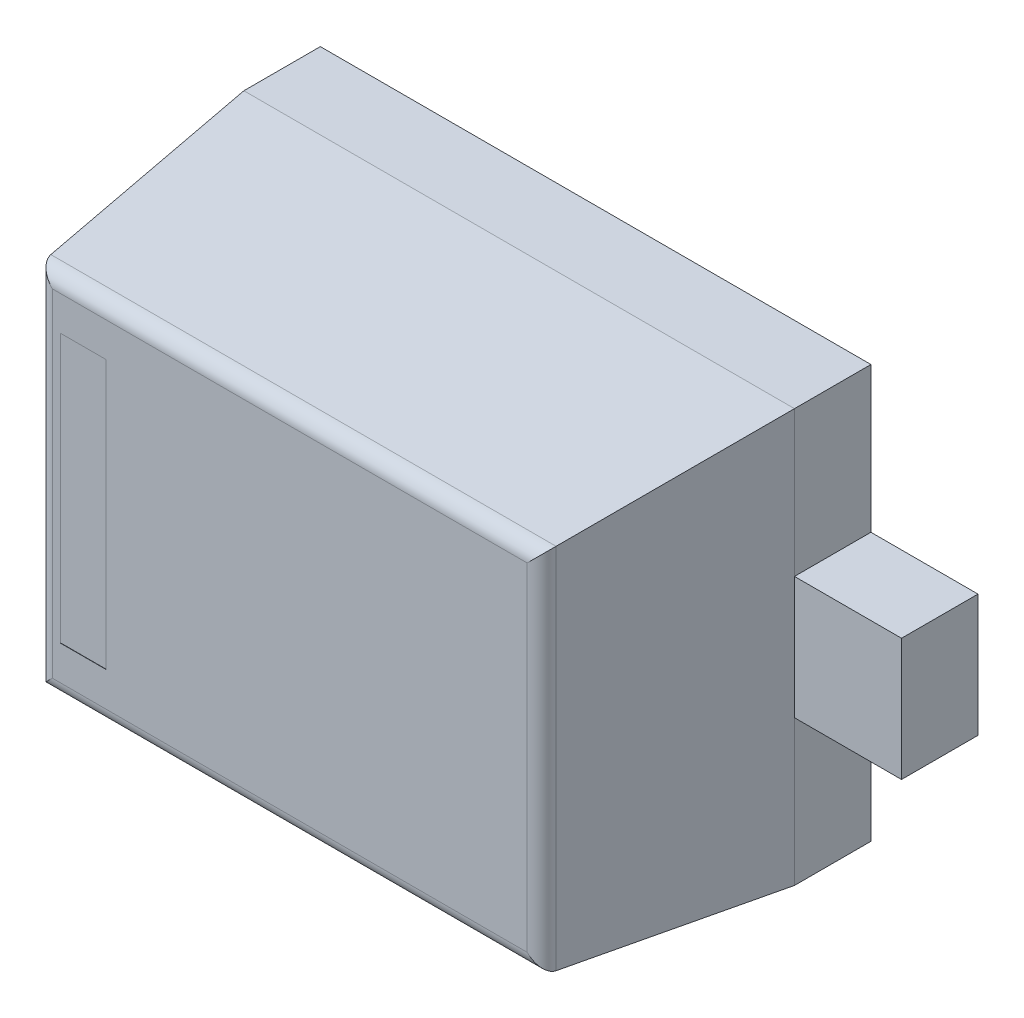
ISO-10303-21;
HEADER;
FILE_DESCRIPTION(('STEP AP214'),'2;1');
FILE_NAME('part.step','',(''),(''),'','','');
FILE_SCHEMA(('AUTOMOTIVE_DESIGN { 1 0 10303 214 1 1 1 1 }'));
ENDSEC;
DATA;
#1=APPLICATION_CONTEXT('core data for automotive mechanical design processes');
#2=APPLICATION_PROTOCOL_DEFINITION('international standard','automotive_design',2000,#1);
#3=PRODUCT_CONTEXT('',#1,'mechanical');
#4=PRODUCT('Part','Part','',(#3));
#5=PRODUCT_RELATED_PRODUCT_CATEGORY('part','',(#4));
#6=PRODUCT_DEFINITION_FORMATION('','',#4);
#7=PRODUCT_DEFINITION_CONTEXT('part definition',#1,'design');
#8=PRODUCT_DEFINITION('design','',#6,#7);
#9=PRODUCT_DEFINITION_SHAPE('','',#8);
#10=(LENGTH_UNIT() NAMED_UNIT(*) SI_UNIT(.MILLI.,.METRE.));
#11=(NAMED_UNIT(*) PLANE_ANGLE_UNIT() SI_UNIT($,.RADIAN.));
#12=(NAMED_UNIT(*) SI_UNIT($,.STERADIAN.) SOLID_ANGLE_UNIT());
#13=UNCERTAINTY_MEASURE_WITH_UNIT(LENGTH_MEASURE(1.E-05),#10,'distance_accuracy_value','');
#14=(GEOMETRIC_REPRESENTATION_CONTEXT(3) GLOBAL_UNCERTAINTY_ASSIGNED_CONTEXT((#13)) GLOBAL_UNIT_ASSIGNED_CONTEXT((#10,
#11,#12)) REPRESENTATION_CONTEXT('',''));
#15=CARTESIAN_POINT('',(0.,0.,0.));
#16=DIRECTION('',(0.,0.,1.));
#17=DIRECTION('',(1.,0.,0.));
#18=AXIS2_PLACEMENT_3D('',#15,#16,#17);
#19=CARTESIAN_POINT('',(-0.9,0.675,1.));
#20=DIRECTION('',(1.,0.,0.));
#21=DIRECTION('',(0.,1.,0.));
#22=AXIS2_PLACEMENT_3D('',#19,#20,#21);
#23=PLANE('',#22);
#24=DIRECTION('',(0.,0.,-1.));
#25=VECTOR('',#24,1.);
#26=CARTESIAN_POINT('',(-0.9,0.2,0.25));
#27=LINE('',#26,#25);
#28=CARTESIAN_POINT('',(-0.9,0.2,0.25));
#29=VERTEX_POINT('',#28);
#30=CARTESIAN_POINT('',(-0.9,0.2,0.));
#31=VERTEX_POINT('',#30);
#32=EDGE_CURVE('E263',#29,#31,#27,.T.);
#33=ORIENTED_EDGE('',*,*,#32,.F.);
#34=DIRECTION('',(0.,1.,0.));
#35=VECTOR('',#34,1.);
#36=CARTESIAN_POINT('',(-0.9,0.675,0.249999999999975));
#37=LINE('',#36,#35);
#38=CARTESIAN_POINT('',(-0.9,0.675,0.249999999999975));
#39=VERTEX_POINT('',#38);
#40=EDGE_CURVE('E11',#29,#39,#37,.T.);
#41=ORIENTED_EDGE('',*,*,#40,.T.);
#42=DIRECTION('',(0.,0.,-1.));
#43=VECTOR('',#42,1.);
#44=CARTESIAN_POINT('',(-0.9,0.675,1.));
#45=LINE('',#44,#43);
#46=CARTESIAN_POINT('',(-0.9,0.675,0.));
#47=VERTEX_POINT('',#46);
#48=EDGE_CURVE('E22',#39,#47,#45,.T.);
#49=ORIENTED_EDGE('',*,*,#48,.T.);
#50=DIRECTION('',(0.,-1.,0.));
#51=VECTOR('',#50,1.);
#52=CARTESIAN_POINT('',(-0.9,0.675,0.));
#53=LINE('',#52,#51);
#54=EDGE_CURVE('E301',#47,#31,#53,.T.);
#55=ORIENTED_EDGE('',*,*,#54,.T.);
#56=EDGE_LOOP('',(#33,#41,#49,#55));
#57=FACE_BOUND('',#56,.T.);
#58=ADVANCED_FACE('F18',(#57),#23,.F.);
#59=CARTESIAN_POINT('',(0.9,0.675,1.));
#60=DIRECTION('',(-1.,0.,0.));
#61=DIRECTION('',(0.,1.,0.));
#62=AXIS2_PLACEMENT_3D('',#59,#60,#61);
#63=PLANE('',#62);
#64=DIRECTION('',(0.,0.,-1.));
#65=VECTOR('',#64,1.);
#66=CARTESIAN_POINT('',(0.9,-0.2,0.25));
#67=LINE('',#66,#65);
#68=CARTESIAN_POINT('',(0.9,-0.2,0.25));
#69=VERTEX_POINT('',#68);
#70=CARTESIAN_POINT('',(0.9,-0.2,0.));
#71=VERTEX_POINT('',#70);
#72=EDGE_CURVE('E267',#69,#71,#67,.T.);
#73=ORIENTED_EDGE('',*,*,#72,.F.);
#74=DIRECTION('',(0.,-1.,0.));
#75=VECTOR('',#74,1.);
#76=CARTESIAN_POINT('',(0.9,-0.675,0.249999999999975));
#77=LINE('',#76,#75);
#78=CARTESIAN_POINT('',(0.9,-0.675,0.249999999999975));
#79=VERTEX_POINT('',#78);
#80=EDGE_CURVE('E305',#69,#79,#77,.T.);
#81=ORIENTED_EDGE('',*,*,#80,.T.);
#82=DIRECTION('',(0.,0.,-1.));
#83=VECTOR('',#82,1.);
#84=CARTESIAN_POINT('',(0.9,-0.675,1.));
#85=LINE('',#84,#83);
#86=CARTESIAN_POINT('',(0.9,-0.675,0.));
#87=VERTEX_POINT('',#86);
#88=EDGE_CURVE('E364',#79,#87,#85,.T.);
#89=ORIENTED_EDGE('',*,*,#88,.T.);
#90=DIRECTION('',(0.,1.,0.));
#91=VECTOR('',#90,1.);
#92=CARTESIAN_POINT('',(0.9,0.675,0.));
#93=LINE('',#92,#91);
#94=EDGE_CURVE('E369',#87,#71,#93,.T.);
#95=ORIENTED_EDGE('',*,*,#94,.T.);
#96=EDGE_LOOP('',(#73,#81,#89,#95));
#97=FACE_BOUND('',#96,.T.);
#98=ADVANCED_FACE('F882',(#97),#63,.F.);
#99=CARTESIAN_POINT('',(0.9,0.675,1.));
#100=DIRECTION('',(-1.,0.,0.));
#101=DIRECTION('',(0.,1.,0.));
#102=AXIS2_PLACEMENT_3D('',#99,#100,#101);
#103=PLANE('',#102);
#104=DIRECTION('',(0.,-1.,0.));
#105=VECTOR('',#104,1.);
#106=CARTESIAN_POINT('',(0.9,-0.675,0.249999999999975));
#107=LINE('',#106,#105);
#108=CARTESIAN_POINT('',(0.9,0.675,0.249999999999975));
#109=VERTEX_POINT('',#108);
#110=CARTESIAN_POINT('',(0.9,0.2,0.25));
#111=VERTEX_POINT('',#110);
#112=EDGE_CURVE('E365',#109,#111,#107,.T.);
#113=ORIENTED_EDGE('',*,*,#112,.T.);
#114=DIRECTION('',(0.,0.,-1.));
#115=VECTOR('',#114,1.);
#116=CARTESIAN_POINT('',(0.9,0.2,0.25));
#117=LINE('',#116,#115);
#118=CARTESIAN_POINT('',(0.9,0.2,0.));
#119=VERTEX_POINT('',#118);
#120=EDGE_CURVE('E351',#111,#119,#117,.T.);
#121=ORIENTED_EDGE('',*,*,#120,.T.);
#122=DIRECTION('',(0.,1.,0.));
#123=VECTOR('',#122,1.);
#124=CARTESIAN_POINT('',(0.9,0.675,0.));
#125=LINE('',#124,#123);
#126=CARTESIAN_POINT('',(0.9,0.675,0.));
#127=VERTEX_POINT('',#126);
#128=EDGE_CURVE('E158',#119,#127,#125,.T.);
#129=ORIENTED_EDGE('',*,*,#128,.T.);
#130=DIRECTION('',(0.,0.,-1.));
#131=VECTOR('',#130,1.);
#132=CARTESIAN_POINT('',(0.9,0.675,1.));
#133=LINE('',#132,#131);
#134=EDGE_CURVE('E147',#109,#127,#133,.T.);
#135=ORIENTED_EDGE('',*,*,#134,.F.);
#136=EDGE_LOOP('',(#113,#121,#129,#135));
#137=FACE_BOUND('',#136,.T.);
#138=ADVANCED_FACE('F835',(#137),#103,.F.);
#139=CARTESIAN_POINT('',(-0.9,0.675,1.));
#140=DIRECTION('',(0.,-1.,0.));
#141=DIRECTION('',(0.,0.,-1.));
#142=AXIS2_PLACEMENT_3D('',#139,#140,#141);
#143=PLANE('',#142);
#144=ORIENTED_EDGE('',*,*,#48,.F.);
#145=DIRECTION('',(1.,0.,0.));
#146=VECTOR('',#145,1.);
#147=CARTESIAN_POINT('',(0.9,0.675,0.249999999999975));
#148=LINE('',#147,#146);
#149=EDGE_CURVE('E352',#39,#109,#148,.T.);
#150=ORIENTED_EDGE('',*,*,#149,.T.);
#151=ORIENTED_EDGE('',*,*,#134,.T.);
#152=DIRECTION('',(-1.,0.,0.));
#153=VECTOR('',#152,1.);
#154=CARTESIAN_POINT('',(-0.9,0.675,0.));
#155=LINE('',#154,#153);
#156=EDGE_CURVE('E253',#127,#47,#155,.T.);
#157=ORIENTED_EDGE('',*,*,#156,.T.);
#158=EDGE_LOOP('',(#144,#150,#151,#157));
#159=FACE_BOUND('',#158,.T.);
#160=ADVANCED_FACE('F521',(#159),#143,.F.);
#161=CARTESIAN_POINT('',(-0.9,0.675,1.));
#162=DIRECTION('',(1.,0.,0.));
#163=DIRECTION('',(0.,1.,0.));
#164=AXIS2_PLACEMENT_3D('',#161,#162,#163);
#165=PLANE('',#164);
#166=DIRECTION('',(0.,1.,0.));
#167=VECTOR('',#166,1.);
#168=CARTESIAN_POINT('',(-0.9,0.675,0.249999999999975));
#169=LINE('',#168,#167);
#170=CARTESIAN_POINT('',(-0.9,-0.675,0.249999999999975));
#171=VERTEX_POINT('',#170);
#172=CARTESIAN_POINT('',(-0.9,-0.2,0.25));
#173=VERTEX_POINT('',#172);
#174=EDGE_CURVE('E228',#171,#173,#169,.T.);
#175=ORIENTED_EDGE('',*,*,#174,.T.);
#176=DIRECTION('',(0.,0.,-1.));
#177=VECTOR('',#176,1.);
#178=CARTESIAN_POINT('',(-0.9,-0.2,0.25));
#179=LINE('',#178,#177);
#180=CARTESIAN_POINT('',(-0.9,-0.2,0.));
#181=VERTEX_POINT('',#180);
#182=EDGE_CURVE('E240',#173,#181,#179,.T.);
#183=ORIENTED_EDGE('',*,*,#182,.T.);
#184=DIRECTION('',(0.,-1.,0.));
#185=VECTOR('',#184,1.);
#186=CARTESIAN_POINT('',(-0.9,0.675,0.));
#187=LINE('',#186,#185);
#188=CARTESIAN_POINT('',(-0.9,-0.675,0.));
#189=VERTEX_POINT('',#188);
#190=EDGE_CURVE('E247',#181,#189,#187,.T.);
#191=ORIENTED_EDGE('',*,*,#190,.T.);
#192=DIRECTION('',(0.,0.,-1.));
#193=VECTOR('',#192,1.);
#194=CARTESIAN_POINT('',(-0.9,-0.675,1.));
#195=LINE('',#194,#193);
#196=EDGE_CURVE('E250',#171,#189,#195,.T.);
#197=ORIENTED_EDGE('',*,*,#196,.F.);
#198=EDGE_LOOP('',(#175,#183,#191,#197));
#199=FACE_BOUND('',#198,.T.);
#200=ADVANCED_FACE('F249',(#199),#165,.F.);
#201=CARTESIAN_POINT('',(-0.9,-0.675,1.));
#202=DIRECTION('',(0.,1.,0.));
#203=DIRECTION('',(1.,0.,0.));
#204=AXIS2_PLACEMENT_3D('',#201,#202,#203);
#205=PLANE('',#204);
#206=ORIENTED_EDGE('',*,*,#88,.F.);
#207=DIRECTION('',(-1.,0.,0.));
#208=VECTOR('',#207,1.);
#209=CARTESIAN_POINT('',(-0.9,-0.675,0.249999999999975));
#210=LINE('',#209,#208);
#211=EDGE_CURVE('E287',#79,#171,#210,.T.);
#212=ORIENTED_EDGE('',*,*,#211,.T.);
#213=ORIENTED_EDGE('',*,*,#196,.T.);
#214=DIRECTION('',(1.,0.,0.));
#215=VECTOR('',#214,1.);
#216=CARTESIAN_POINT('',(-0.9,-0.675,0.));
#217=LINE('',#216,#215);
#218=EDGE_CURVE('E327',#189,#87,#217,.T.);
#219=ORIENTED_EDGE('',*,*,#218,.T.);
#220=EDGE_LOOP('',(#206,#212,#213,#219));
#221=FACE_BOUND('',#220,.T.);
#222=ADVANCED_FACE('F849',(#221),#205,.F.);
#223=CARTESIAN_POINT('',(0.,0.,1.));
#224=DIRECTION('',(0.,0.,1.));
#225=DIRECTION('',(1.,0.,0.));
#226=AXIS2_PLACEMENT_3D('',#223,#224,#225);
#227=PLANE('',#226);
#228=DIRECTION('',(0.,1.,0.));
#229=VECTOR('',#228,1.);
#230=CARTESIAN_POINT('',(0.776151621335851,0.,1.));
#231=LINE('',#230,#229);
#232=CARTESIAN_POINT('',(0.776151621335851,-0.551151621335851,1.));
#233=VERTEX_POINT('',#232);
#234=CARTESIAN_POINT('',(0.776151621335851,0.551151621335851,1.));
#235=VERTEX_POINT('',#234);
#236=EDGE_CURVE('E331',#233,#235,#231,.T.);
#237=ORIENTED_EDGE('',*,*,#236,.T.);
#238=DIRECTION('',(-1.,0.,0.));
#239=VECTOR('',#238,1.);
#240=CARTESIAN_POINT('',(0.,0.551151621335851,1.));
#241=LINE('',#240,#239);
#242=CARTESIAN_POINT('',(-0.77615162133585,0.551151621335851,1.));
#243=VERTEX_POINT('',#242);
#244=EDGE_CURVE('E346',#235,#243,#241,.T.);
#245=ORIENTED_EDGE('',*,*,#244,.T.);
#246=DIRECTION('',(0.,-1.,0.));
#247=VECTOR('',#246,1.);
#248=CARTESIAN_POINT('',(-0.77615162133585,0.,1.));
#249=LINE('',#248,#247);
#250=CARTESIAN_POINT('',(-0.77615162133585,-0.551151621335851,1.));
#251=VERTEX_POINT('',#250);
#252=EDGE_CURVE('E342',#243,#251,#249,.T.);
#253=ORIENTED_EDGE('',*,*,#252,.T.);
#254=DIRECTION('',(1.,0.,0.));
#255=VECTOR('',#254,1.);
#256=CARTESIAN_POINT('',(0.,-0.551151621335851,1.));
#257=LINE('',#256,#255);
#258=EDGE_CURVE('E347',#251,#233,#257,.T.);
#259=ORIENTED_EDGE('',*,*,#258,.T.);
#260=EDGE_LOOP('',(#237,#245,#253,#259));
#261=FACE_BOUND('',#260,.T.);
#262=DIRECTION('',(0.,1.,0.));
#263=VECTOR('',#262,1.);
#264=CARTESIAN_POINT('',(-0.6,0.43875,1.));
#265=LINE('',#264,#263);
#266=CARTESIAN_POINT('',(-0.6,-0.43875,1.));
#267=VERTEX_POINT('',#266);
#268=CARTESIAN_POINT('',(-0.6,0.43875,1.));
#269=VERTEX_POINT('',#268);
#270=EDGE_CURVE('E294',#267,#269,#265,.T.);
#271=ORIENTED_EDGE('',*,*,#270,.F.);
#272=DIRECTION('',(1.,0.,0.));
#273=VECTOR('',#272,1.);
#274=CARTESIAN_POINT('',(-0.75,-0.43875,1.));
#275=LINE('',#274,#273);
#276=CARTESIAN_POINT('',(-0.75,-0.43875,1.));
#277=VERTEX_POINT('',#276);
#278=EDGE_CURVE('E295',#277,#267,#275,.T.);
#279=ORIENTED_EDGE('',*,*,#278,.F.);
#280=DIRECTION('',(0.,-1.,0.));
#281=VECTOR('',#280,1.);
#282=CARTESIAN_POINT('',(-0.75,0.43875,1.));
#283=LINE('',#282,#281);
#284=CARTESIAN_POINT('',(-0.75,0.43875,1.));
#285=VERTEX_POINT('',#284);
#286=EDGE_CURVE('E354',#285,#277,#283,.T.);
#287=ORIENTED_EDGE('',*,*,#286,.F.);
#288=DIRECTION('',(-1.,0.,0.));
#289=VECTOR('',#288,1.);
#290=CARTESIAN_POINT('',(-0.75,0.43875,1.));
#291=LINE('',#290,#289);
#292=EDGE_CURVE('E393',#269,#285,#291,.T.);
#293=ORIENTED_EDGE('',*,*,#292,.F.);
#294=EDGE_LOOP('',(#271,#279,#287,#293));
#295=FACE_BOUND('',#294,.T.);
#296=ADVANCED_FACE('F843',(#261,#295),#227,.T.);
#297=CARTESIAN_POINT('',(0.,0.,0.));
#298=DIRECTION('',(0.,0.,1.));
#299=DIRECTION('',(1.,0.,0.));
#300=AXIS2_PLACEMENT_3D('',#297,#298,#299);
#301=PLANE('',#300);
#302=ORIENTED_EDGE('',*,*,#94,.F.);
#303=ORIENTED_EDGE('',*,*,#218,.F.);
#304=ORIENTED_EDGE('',*,*,#190,.F.);
#305=DIRECTION('',(1.,0.,0.));
#306=VECTOR('',#305,1.);
#307=CARTESIAN_POINT('',(-0.9,-0.2,0.));
#308=LINE('',#307,#306);
#309=CARTESIAN_POINT('',(-1.25,-0.2,0.));
#310=VERTEX_POINT('',#309);
#311=EDGE_CURVE('E243',#310,#181,#308,.T.);
#312=ORIENTED_EDGE('',*,*,#311,.F.);
#313=DIRECTION('',(0.,-1.,0.));
#314=VECTOR('',#313,1.);
#315=CARTESIAN_POINT('',(-1.25,0.2,0.));
#316=LINE('',#315,#314);
#317=CARTESIAN_POINT('',(-1.25,0.2,0.));
#318=VERTEX_POINT('',#317);
#319=EDGE_CURVE('E326',#318,#310,#316,.T.);
#320=ORIENTED_EDGE('',*,*,#319,.F.);
#321=DIRECTION('',(-1.,0.,0.));
#322=VECTOR('',#321,1.);
#323=CARTESIAN_POINT('',(-0.9,0.2,0.));
#324=LINE('',#323,#322);
#325=EDGE_CURVE('E385',#31,#318,#324,.T.);
#326=ORIENTED_EDGE('',*,*,#325,.F.);
#327=ORIENTED_EDGE('',*,*,#54,.F.);
#328=ORIENTED_EDGE('',*,*,#156,.F.);
#329=ORIENTED_EDGE('',*,*,#128,.F.);
#330=DIRECTION('',(-1.,0.,0.));
#331=VECTOR('',#330,1.);
#332=CARTESIAN_POINT('',(0.9,0.2,0.));
#333=LINE('',#332,#331);
#334=CARTESIAN_POINT('',(1.25,0.2,0.));
#335=VERTEX_POINT('',#334);
#336=EDGE_CURVE('E300',#335,#119,#333,.T.);
#337=ORIENTED_EDGE('',*,*,#336,.F.);
#338=DIRECTION('',(0.,1.,0.));
#339=VECTOR('',#338,1.);
#340=CARTESIAN_POINT('',(1.25,-0.2,0.));
#341=LINE('',#340,#339);
#342=CARTESIAN_POINT('',(1.25,-0.2,0.));
#343=VERTEX_POINT('',#342);
#344=EDGE_CURVE('E286',#343,#335,#341,.T.);
#345=ORIENTED_EDGE('',*,*,#344,.F.);
#346=DIRECTION('',(1.,0.,0.));
#347=VECTOR('',#346,1.);
#348=CARTESIAN_POINT('',(0.9,-0.2,0.));
#349=LINE('',#348,#347);
#350=EDGE_CURVE('E310',#71,#343,#349,.T.);
#351=ORIENTED_EDGE('',*,*,#350,.F.);
#352=EDGE_LOOP('',(#302,#303,#304,#312,#320,#326,#327,#328,#329,#337,#345,#351));
#353=FACE_BOUND('',#352,.T.);
#354=ADVANCED_FACE('F848',(#353),#301,.F.);
#355=CARTESIAN_POINT('',(0.,0.596171823550743,1.));
#356=DIRECTION('',(0.,0.994521895368274,0.10452846326765));
#357=DIRECTION('',(1.,0.,0.));
#358=AXIS2_PLACEMENT_3D('',#355,#356,#357);
#359=PLANE('',#358);
#360=DIRECTION('',(-0.103962051184494,0.103962051184494,-0.989132844377855));
#361=VECTOR('',#360,1.);
#362=CARTESIAN_POINT('',(-0.812296509724228,0.587296509724228,1.08444297039106));
#363=LINE('',#362,#361);
#364=CARTESIAN_POINT('',(-0.825877716104264,0.600877716104264,0.955226423163382));
#365=VERTEX_POINT('',#364);
#366=EDGE_CURVE('E332',#365,#39,#363,.T.);
#367=ORIENTED_EDGE('',*,*,#366,.F.);
#368=DIRECTION('',(1.,0.,0.));
#369=VECTOR('',#368,1.);
#370=CARTESIAN_POINT('',(0.,0.600877716104264,0.955226423163382));
#371=LINE('',#370,#369);
#372=CARTESIAN_POINT('',(0.825877716104264,0.600877716104264,0.955226423163382));
#373=VERTEX_POINT('',#372);
#374=EDGE_CURVE('E381',#365,#373,#371,.T.);
#375=ORIENTED_EDGE('',*,*,#374,.T.);
#376=DIRECTION('',(-0.103962051184494,-0.103962051184494,0.989132844377855));
#377=VECTOR('',#376,1.);
#378=CARTESIAN_POINT('',(0.814728334043688,0.589728334043688,1.06130570752708));
#379=LINE('',#378,#377);
#380=EDGE_CURVE('E336',#109,#373,#379,.T.);
#381=ORIENTED_EDGE('',*,*,#380,.F.);
#382=ORIENTED_EDGE('',*,*,#149,.F.);
#383=EDGE_LOOP('',(#367,#375,#381,#382));
#384=FACE_BOUND('',#383,.T.);
#385=ADVANCED_FACE('F518',(#384),#359,.T.);
#386=CARTESIAN_POINT('',(-0.821171823550742,0.,1.));
#387=DIRECTION('',(-0.994521895368274,0.,0.10452846326765));
#388=DIRECTION('',(0.,1.,0.));
#389=AXIS2_PLACEMENT_3D('',#386,#387,#388);
#390=PLANE('',#389);
#391=DIRECTION('',(-0.103962051184494,-0.103962051184494,-0.989132844377855));
#392=VECTOR('',#391,1.);
#393=CARTESIAN_POINT('',(-0.814728334043688,-0.589728334043688,1.06130570752708));
#394=LINE('',#393,#392);
#395=CARTESIAN_POINT('',(-0.825877716104264,-0.600877716104264,0.955226423163382));
#396=VERTEX_POINT('',#395);
#397=EDGE_CURVE('E317',#396,#171,#394,.T.);
#398=ORIENTED_EDGE('',*,*,#397,.F.);
#399=DIRECTION('',(0.,1.,0.));
#400=VECTOR('',#399,1.);
#401=CARTESIAN_POINT('',(-0.825877716104264,0.,0.955226423163382));
#402=LINE('',#401,#400);
#403=EDGE_CURVE('E335',#396,#365,#402,.T.);
#404=ORIENTED_EDGE('',*,*,#403,.T.);
#405=ORIENTED_EDGE('',*,*,#366,.T.);
#406=ORIENTED_EDGE('',*,*,#40,.F.);
#407=DIRECTION('',(0.,1.,0.));
#408=VECTOR('',#407,1.);
#409=CARTESIAN_POINT('',(-0.9,0.2,0.25));
#410=LINE('',#409,#408);
#411=EDGE_CURVE('E43',#173,#29,#410,.T.);
#412=ORIENTED_EDGE('',*,*,#411,.F.);
#413=ORIENTED_EDGE('',*,*,#174,.F.);
#414=EDGE_LOOP('',(#398,#404,#405,#406,#412,#413));
#415=FACE_BOUND('',#414,.T.);
#416=ADVANCED_FACE('F226',(#415),#390,.T.);
#417=CARTESIAN_POINT('',(0.821171823550743,0.,1.));
#418=DIRECTION('',(0.994521895368274,0.,0.10452846326765));
#419=DIRECTION('',(0.,-1.,0.));
#420=AXIS2_PLACEMENT_3D('',#417,#418,#419);
#421=PLANE('',#420);
#422=ORIENTED_EDGE('',*,*,#380,.T.);
#423=DIRECTION('',(0.,-1.,0.));
#424=VECTOR('',#423,1.);
#425=CARTESIAN_POINT('',(0.825877716104264,0.,0.955226423163382));
#426=LINE('',#425,#424);
#427=CARTESIAN_POINT('',(0.825877716104264,-0.600877716104264,0.955226423163382));
#428=VERTEX_POINT('',#427);
#429=EDGE_CURVE('E378',#373,#428,#426,.T.);
#430=ORIENTED_EDGE('',*,*,#429,.T.);
#431=DIRECTION('',(-0.103962051184494,0.103962051184494,0.989132844377855));
#432=VECTOR('',#431,1.);
#433=CARTESIAN_POINT('',(0.814728334043688,-0.589728334043688,1.06130570752708));
#434=LINE('',#433,#432);
#435=EDGE_CURVE('E341',#79,#428,#434,.T.);
#436=ORIENTED_EDGE('',*,*,#435,.F.);
#437=ORIENTED_EDGE('',*,*,#80,.F.);
#438=DIRECTION('',(0.,-1.,0.));
#439=VECTOR('',#438,1.);
#440=CARTESIAN_POINT('',(0.9,-0.2,0.25));
#441=LINE('',#440,#439);
#442=EDGE_CURVE('E325',#111,#69,#441,.T.);
#443=ORIENTED_EDGE('',*,*,#442,.F.);
#444=ORIENTED_EDGE('',*,*,#112,.F.);
#445=EDGE_LOOP('',(#422,#430,#436,#437,#443,#444));
#446=FACE_BOUND('',#445,.T.);
#447=ADVANCED_FACE('F500',(#446),#421,.T.);
#448=CARTESIAN_POINT('',(0.,-0.596171823550743,1.));
#449=DIRECTION('',(0.,-0.994521895368274,0.10452846326765));
#450=DIRECTION('',(-1.,0.,0.));
#451=AXIS2_PLACEMENT_3D('',#448,#449,#450);
#452=PLANE('',#451);
#453=ORIENTED_EDGE('',*,*,#435,.T.);
#454=DIRECTION('',(-1.,0.,0.));
#455=VECTOR('',#454,1.);
#456=CARTESIAN_POINT('',(0.,-0.600877716104264,0.955226423163382));
#457=LINE('',#456,#455);
#458=EDGE_CURVE('E337',#428,#396,#457,.T.);
#459=ORIENTED_EDGE('',*,*,#458,.T.);
#460=ORIENTED_EDGE('',*,*,#397,.T.);
#461=ORIENTED_EDGE('',*,*,#211,.F.);
#462=EDGE_LOOP('',(#453,#459,#460,#461));
#463=FACE_BOUND('',#462,.T.);
#464=ADVANCED_FACE('F496',(#463),#452,.T.);
#465=CARTESIAN_POINT('',(0.,-0.551151621335851,0.95));
#466=DIRECTION('',(1.,0.,0.));
#467=DIRECTION('',(0.,0.,-1.));
#468=AXIS2_PLACEMENT_3D('',#465,#466,#467);
#469=CYLINDRICAL_SURFACE('',#468,0.05);
#470=CARTESIAN_POINT('',(-0.825877716104264,-0.600877716104264,0.955226423163382));
#471=CARTESIAN_POINT('',(-0.823064560606425,-0.598064560606425,0.981991809836226));
#472=CARTESIAN_POINT('',(-0.803064439241113,-0.578064439241113,1.));
#473=CARTESIAN_POINT('',(-0.77615162133585,-0.551151621335851,1.));
#474=(BOUNDED_CURVE() B_SPLINE_CURVE(3,(#470,#471,#472,#473),.UNSPECIFIED.,.F.,
.F.) B_SPLINE_CURVE_WITH_KNOTS((4,4),(0.104719755119658,1.5707963267949),
.UNSPECIFIED.) CURVE() GEOMETRIC_REPRESENTATION_ITEM() RATIONAL_B_SPLINE_CURVE((1.,
0.828763216984929,0.828763216984929,1.)) REPRESENTATION_ITEM(''));
#475=EDGE_CURVE('E275',#396,#251,#474,.T.);
#476=ORIENTED_EDGE('',*,*,#475,.F.);
#477=ORIENTED_EDGE('',*,*,#458,.F.);
#478=CARTESIAN_POINT('',(0.776151621335851,-0.551151621335851,1.));
#479=CARTESIAN_POINT('',(0.803064439241114,-0.578064439241113,1.));
#480=CARTESIAN_POINT('',(0.823064560606425,-0.598064560606425,0.981991809836226));
#481=CARTESIAN_POINT('',(0.825877716104264,-0.600877716104264,0.955226423163382));
#482=(BOUNDED_CURVE() B_SPLINE_CURVE(3,(#478,#479,#480,#481),.UNSPECIFIED.,.F.,
.F.) B_SPLINE_CURVE_WITH_KNOTS((4,4),(4.71238898038469,6.17846555205993),
.UNSPECIFIED.) CURVE() GEOMETRIC_REPRESENTATION_ITEM() RATIONAL_B_SPLINE_CURVE((1.,
0.828763216984929,0.828763216984929,1.)) REPRESENTATION_ITEM(''));
#483=EDGE_CURVE('E311',#233,#428,#482,.T.);
#484=ORIENTED_EDGE('',*,*,#483,.F.);
#485=ORIENTED_EDGE('',*,*,#258,.F.);
#486=EDGE_LOOP('',(#476,#477,#484,#485));
#487=FACE_BOUND('',#486,.T.);
#488=ADVANCED_FACE('F510',(#487),#469,.T.);
#489=CARTESIAN_POINT('',(0.776151621335851,0.,0.95));
#490=DIRECTION('',(0.,1.,0.));
#491=DIRECTION('',(-1.,0.,0.));
#492=AXIS2_PLACEMENT_3D('',#489,#490,#491);
#493=CYLINDRICAL_SURFACE('',#492,0.05);
#494=ORIENTED_EDGE('',*,*,#483,.T.);
#495=ORIENTED_EDGE('',*,*,#429,.F.);
#496=CARTESIAN_POINT('',(0.776151621335851,0.551151621335851,1.));
#497=CARTESIAN_POINT('',(0.803064439241114,0.578064439241113,1.));
#498=CARTESIAN_POINT('',(0.823064560606425,0.598064560606425,0.981991809836227));
#499=CARTESIAN_POINT('',(0.825877716104264,0.600877716104264,0.955226423163382));
#500=(BOUNDED_CURVE() B_SPLINE_CURVE(3,(#496,#497,#498,#499),.UNSPECIFIED.,.F.,
.F.) B_SPLINE_CURVE_WITH_KNOTS((4,4),(4.71238898038469,6.17846555205993),
.UNSPECIFIED.) CURVE() GEOMETRIC_REPRESENTATION_ITEM() RATIONAL_B_SPLINE_CURVE((1.,
0.828763216984929,0.828763216984929,1.)) REPRESENTATION_ITEM(''));
#501=EDGE_CURVE('E269',#235,#373,#500,.T.);
#502=ORIENTED_EDGE('',*,*,#501,.F.);
#503=ORIENTED_EDGE('',*,*,#236,.F.);
#504=EDGE_LOOP('',(#494,#495,#502,#503));
#505=FACE_BOUND('',#504,.T.);
#506=ADVANCED_FACE('F507',(#505),#493,.T.);
#507=CARTESIAN_POINT('',(-0.77615162133585,0.,0.95));
#508=DIRECTION('',(0.,-1.,0.));
#509=DIRECTION('',(1.,0.,0.));
#510=AXIS2_PLACEMENT_3D('',#507,#508,#509);
#511=CYLINDRICAL_SURFACE('',#510,0.05);
#512=ORIENTED_EDGE('',*,*,#475,.T.);
#513=ORIENTED_EDGE('',*,*,#252,.F.);
#514=CARTESIAN_POINT('',(-0.825877716104264,0.600877716104264,0.955226423163382));
#515=CARTESIAN_POINT('',(-0.823064560606424,0.598064560606425,0.981991809836226));
#516=CARTESIAN_POINT('',(-0.803064439241113,0.578064439241113,1.));
#517=CARTESIAN_POINT('',(-0.77615162133585,0.551151621335851,1.));
#518=(BOUNDED_CURVE() B_SPLINE_CURVE(3,(#514,#515,#516,#517),.UNSPECIFIED.,.F.,
.F.) B_SPLINE_CURVE_WITH_KNOTS((4,4),(3.24631240870945,4.71238898038469),
.UNSPECIFIED.) CURVE() GEOMETRIC_REPRESENTATION_ITEM() RATIONAL_B_SPLINE_CURVE((1.,
0.828763216984929,0.828763216984929,1.)) REPRESENTATION_ITEM(''));
#519=EDGE_CURVE('E276',#365,#243,#518,.T.);
#520=ORIENTED_EDGE('',*,*,#519,.F.);
#521=ORIENTED_EDGE('',*,*,#403,.F.);
#522=EDGE_LOOP('',(#512,#513,#520,#521));
#523=FACE_BOUND('',#522,.T.);
#524=ADVANCED_FACE('F512',(#523),#511,.T.);
#525=CARTESIAN_POINT('',(0.,0.551151621335851,0.95));
#526=DIRECTION('',(-1.,0.,0.));
#527=DIRECTION('',(0.,0.,1.));
#528=AXIS2_PLACEMENT_3D('',#525,#526,#527);
#529=CYLINDRICAL_SURFACE('',#528,0.05);
#530=ORIENTED_EDGE('',*,*,#501,.T.);
#531=ORIENTED_EDGE('',*,*,#374,.F.);
#532=ORIENTED_EDGE('',*,*,#519,.T.);
#533=ORIENTED_EDGE('',*,*,#244,.F.);
#534=EDGE_LOOP('',(#530,#531,#532,#533));
#535=FACE_BOUND('',#534,.T.);
#536=ADVANCED_FACE('F516',(#535),#529,.T.);
#537=CARTESIAN_POINT('',(-0.6,0.43875,0.999));
#538=DIRECTION('',(1.,0.,0.));
#539=DIRECTION('',(0.,1.,0.));
#540=AXIS2_PLACEMENT_3D('',#537,#538,#539);
#541=PLANE('',#540);
#542=ORIENTED_EDGE('',*,*,#270,.T.);
#543=DIRECTION('',(0.,0.,1.));
#544=VECTOR('',#543,1.);
#545=CARTESIAN_POINT('',(-0.6,0.43875,0.999));
#546=LINE('',#545,#544);
#547=CARTESIAN_POINT('',(-0.6,0.43875,0.999));
#548=VERTEX_POINT('',#547);
#549=EDGE_CURVE('E474',#548,#269,#546,.T.);
#550=ORIENTED_EDGE('',*,*,#549,.F.);
#551=DIRECTION('',(0.,1.,0.));
#552=VECTOR('',#551,1.);
#553=CARTESIAN_POINT('',(-0.6,0.43875,0.999));
#554=LINE('',#553,#552);
#555=CARTESIAN_POINT('',(-0.6,-0.43875,0.999));
#556=VERTEX_POINT('',#555);
#557=EDGE_CURVE('E472',#556,#548,#554,.T.);
#558=ORIENTED_EDGE('',*,*,#557,.F.);
#559=DIRECTION('',(0.,0.,1.));
#560=VECTOR('',#559,1.);
#561=CARTESIAN_POINT('',(-0.6,-0.43875,0.999));
#562=LINE('',#561,#560);
#563=EDGE_CURVE('E290',#556,#267,#562,.T.);
#564=ORIENTED_EDGE('',*,*,#563,.T.);
#565=EDGE_LOOP('',(#542,#550,#558,#564));
#566=FACE_BOUND('',#565,.T.);
#567=ADVANCED_FACE('F989',(#566),#541,.F.);
#568=CARTESIAN_POINT('',(-0.75,-0.43875,0.999));
#569=DIRECTION('',(0.,-1.,0.));
#570=DIRECTION('',(0.,0.,-1.));
#571=AXIS2_PLACEMENT_3D('',#568,#569,#570);
#572=PLANE('',#571);
#573=ORIENTED_EDGE('',*,*,#278,.T.);
#574=ORIENTED_EDGE('',*,*,#563,.F.);
#575=DIRECTION('',(1.,0.,0.));
#576=VECTOR('',#575,1.);
#577=CARTESIAN_POINT('',(-0.75,-0.43875,0.999));
#578=LINE('',#577,#576);
#579=CARTESIAN_POINT('',(-0.75,-0.43875,0.999));
#580=VERTEX_POINT('',#579);
#581=EDGE_CURVE('E187',#580,#556,#578,.T.);
#582=ORIENTED_EDGE('',*,*,#581,.F.);
#583=DIRECTION('',(0.,0.,1.));
#584=VECTOR('',#583,1.);
#585=CARTESIAN_POINT('',(-0.75,-0.43875,0.999));
#586=LINE('',#585,#584);
#587=EDGE_CURVE('E357',#580,#277,#586,.T.);
#588=ORIENTED_EDGE('',*,*,#587,.T.);
#589=EDGE_LOOP('',(#573,#574,#582,#588));
#590=FACE_BOUND('',#589,.T.);
#591=ADVANCED_FACE('F971',(#590),#572,.F.);
#592=CARTESIAN_POINT('',(-0.75,0.43875,0.999));
#593=DIRECTION('',(-1.,0.,0.));
#594=DIRECTION('',(0.,1.,0.));
#595=AXIS2_PLACEMENT_3D('',#592,#593,#594);
#596=PLANE('',#595);
#597=ORIENTED_EDGE('',*,*,#286,.T.);
#598=ORIENTED_EDGE('',*,*,#587,.F.);
#599=DIRECTION('',(0.,-1.,0.));
#600=VECTOR('',#599,1.);
#601=CARTESIAN_POINT('',(-0.75,0.43875,0.999));
#602=LINE('',#601,#600);
#603=CARTESIAN_POINT('',(-0.75,0.43875,0.999));
#604=VERTEX_POINT('',#603);
#605=EDGE_CURVE('E199',#604,#580,#602,.T.);
#606=ORIENTED_EDGE('',*,*,#605,.F.);
#607=DIRECTION('',(0.,0.,1.));
#608=VECTOR('',#607,1.);
#609=CARTESIAN_POINT('',(-0.75,0.43875,0.999));
#610=LINE('',#609,#608);
#611=EDGE_CURVE('E358',#604,#285,#610,.T.);
#612=ORIENTED_EDGE('',*,*,#611,.T.);
#613=EDGE_LOOP('',(#597,#598,#606,#612));
#614=FACE_BOUND('',#613,.T.);
#615=ADVANCED_FACE('F966',(#614),#596,.F.);
#616=CARTESIAN_POINT('',(-0.75,0.43875,0.999));
#617=DIRECTION('',(0.,1.,0.));
#618=DIRECTION('',(1.,0.,0.));
#619=AXIS2_PLACEMENT_3D('',#616,#617,#618);
#620=PLANE('',#619);
#621=ORIENTED_EDGE('',*,*,#292,.T.);
#622=ORIENTED_EDGE('',*,*,#611,.F.);
#623=DIRECTION('',(-1.,0.,0.));
#624=VECTOR('',#623,1.);
#625=CARTESIAN_POINT('',(-0.75,0.43875,0.999));
#626=LINE('',#625,#624);
#627=EDGE_CURVE('E455',#548,#604,#626,.T.);
#628=ORIENTED_EDGE('',*,*,#627,.F.);
#629=ORIENTED_EDGE('',*,*,#549,.T.);
#630=EDGE_LOOP('',(#621,#622,#628,#629));
#631=FACE_BOUND('',#630,.T.);
#632=ADVANCED_FACE('F925',(#631),#620,.F.);
#633=CARTESIAN_POINT('',(0.,0.,0.999));
#634=DIRECTION('',(0.,0.,1.));
#635=DIRECTION('',(1.,0.,0.));
#636=AXIS2_PLACEMENT_3D('',#633,#634,#635);
#637=PLANE('',#636);
#638=ORIENTED_EDGE('',*,*,#557,.T.);
#639=ORIENTED_EDGE('',*,*,#627,.T.);
#640=ORIENTED_EDGE('',*,*,#605,.T.);
#641=ORIENTED_EDGE('',*,*,#581,.T.);
#642=EDGE_LOOP('',(#638,#639,#640,#641));
#643=FACE_BOUND('',#642,.T.);
#644=ADVANCED_FACE('F919',(#643),#637,.T.);
#645=CARTESIAN_POINT('',(1.25,-0.2,0.25));
#646=DIRECTION('',(-1.,0.,0.));
#647=DIRECTION('',(0.,0.,1.));
#648=AXIS2_PLACEMENT_3D('',#645,#646,#647);
#649=PLANE('',#648);
#650=ORIENTED_EDGE('',*,*,#344,.T.);
#651=DIRECTION('',(0.,0.,-1.));
#652=VECTOR('',#651,1.);
#653=CARTESIAN_POINT('',(1.25,0.2,0.25));
#654=LINE('',#653,#652);
#655=CARTESIAN_POINT('',(1.25,0.2,0.25));
#656=VERTEX_POINT('',#655);
#657=EDGE_CURVE('E306',#656,#335,#654,.T.);
#658=ORIENTED_EDGE('',*,*,#657,.F.);
#659=DIRECTION('',(0.,1.,0.));
#660=VECTOR('',#659,1.);
#661=CARTESIAN_POINT('',(1.25,-0.2,0.25));
#662=LINE('',#661,#660);
#663=CARTESIAN_POINT('',(1.25,-0.2,0.25));
#664=VERTEX_POINT('',#663);
#665=EDGE_CURVE('E413',#664,#656,#662,.T.);
#666=ORIENTED_EDGE('',*,*,#665,.F.);
#667=DIRECTION('',(0.,0.,-1.));
#668=VECTOR('',#667,1.);
#669=CARTESIAN_POINT('',(1.25,-0.2,0.25));
#670=LINE('',#669,#668);
#671=EDGE_CURVE('E296',#664,#343,#670,.T.);
#672=ORIENTED_EDGE('',*,*,#671,.T.);
#673=EDGE_LOOP('',(#650,#658,#666,#672));
#674=FACE_BOUND('',#673,.T.);
#675=ADVANCED_FACE('F924',(#674),#649,.F.);
#676=CARTESIAN_POINT('',(0.9,0.2,0.25));
#677=DIRECTION('',(0.,-1.,0.));
#678=DIRECTION('',(0.,0.,-1.));
#679=AXIS2_PLACEMENT_3D('',#676,#677,#678);
#680=PLANE('',#679);
#681=ORIENTED_EDGE('',*,*,#336,.T.);
#682=ORIENTED_EDGE('',*,*,#120,.F.);
#683=DIRECTION('',(-1.,0.,0.));
#684=VECTOR('',#683,1.);
#685=CARTESIAN_POINT('',(0.9,0.2,0.25));
#686=LINE('',#685,#684);
#687=EDGE_CURVE('E409',#656,#111,#686,.T.);
#688=ORIENTED_EDGE('',*,*,#687,.F.);
#689=ORIENTED_EDGE('',*,*,#657,.T.);
#690=EDGE_LOOP('',(#681,#682,#688,#689));
#691=FACE_BOUND('',#690,.T.);
#692=ADVANCED_FACE('F947',(#691),#680,.F.);
#693=CARTESIAN_POINT('',(0.9,-0.2,0.25));
#694=DIRECTION('',(0.,1.,0.));
#695=DIRECTION('',(1.,0.,0.));
#696=AXIS2_PLACEMENT_3D('',#693,#694,#695);
#697=PLANE('',#696);
#698=ORIENTED_EDGE('',*,*,#350,.T.);
#699=ORIENTED_EDGE('',*,*,#671,.F.);
#700=DIRECTION('',(1.,0.,0.));
#701=VECTOR('',#700,1.);
#702=CARTESIAN_POINT('',(0.9,-0.2,0.25));
#703=LINE('',#702,#701);
#704=EDGE_CURVE('E318',#69,#664,#703,.T.);
#705=ORIENTED_EDGE('',*,*,#704,.F.);
#706=ORIENTED_EDGE('',*,*,#72,.T.);
#707=EDGE_LOOP('',(#698,#699,#705,#706));
#708=FACE_BOUND('',#707,.T.);
#709=ADVANCED_FACE('F909',(#708),#697,.F.);
#710=CARTESIAN_POINT('',(0.,0.,0.25));
#711=DIRECTION('',(0.,0.,-1.));
#712=DIRECTION('',(0.,-1.,0.));
#713=AXIS2_PLACEMENT_3D('',#710,#711,#712);
#714=PLANE('',#713);
#715=ORIENTED_EDGE('',*,*,#665,.T.);
#716=ORIENTED_EDGE('',*,*,#687,.T.);
#717=ORIENTED_EDGE('',*,*,#442,.T.);
#718=ORIENTED_EDGE('',*,*,#704,.T.);
#719=EDGE_LOOP('',(#715,#716,#717,#718));
#720=FACE_BOUND('',#719,.T.);
#721=ADVANCED_FACE('F904',(#720),#714,.F.);
#722=CARTESIAN_POINT('',(-1.25,0.2,0.25));
#723=DIRECTION('',(1.,0.,0.));
#724=DIRECTION('',(0.,1.,0.));
#725=AXIS2_PLACEMENT_3D('',#722,#723,#724);
#726=PLANE('',#725);
#727=ORIENTED_EDGE('',*,*,#319,.T.);
#728=DIRECTION('',(0.,0.,-1.));
#729=VECTOR('',#728,1.);
#730=CARTESIAN_POINT('',(-1.25,-0.2,0.25));
#731=LINE('',#730,#729);
#732=CARTESIAN_POINT('',(-1.25,-0.2,0.25));
#733=VERTEX_POINT('',#732);
#734=EDGE_CURVE('E283',#733,#310,#731,.T.);
#735=ORIENTED_EDGE('',*,*,#734,.F.);
#736=DIRECTION('',(0.,-1.,0.));
#737=VECTOR('',#736,1.);
#738=CARTESIAN_POINT('',(-1.25,0.2,0.25));
#739=LINE('',#738,#737);
#740=CARTESIAN_POINT('',(-1.25,0.2,0.25));
#741=VERTEX_POINT('',#740);
#742=EDGE_CURVE('E255',#741,#733,#739,.T.);
#743=ORIENTED_EDGE('',*,*,#742,.F.);
#744=DIRECTION('',(0.,0.,-1.));
#745=VECTOR('',#744,1.);
#746=CARTESIAN_POINT('',(-1.25,0.2,0.25));
#747=LINE('',#746,#745);
#748=EDGE_CURVE('E282',#741,#318,#747,.T.);
#749=ORIENTED_EDGE('',*,*,#748,.T.);
#750=EDGE_LOOP('',(#727,#735,#743,#749));
#751=FACE_BOUND('',#750,.T.);
#752=ADVANCED_FACE('F871',(#751),#726,.F.);
#753=CARTESIAN_POINT('',(-0.9,-0.2,0.25));
#754=DIRECTION('',(0.,1.,0.));
#755=DIRECTION('',(1.,0.,0.));
#756=AXIS2_PLACEMENT_3D('',#753,#754,#755);
#757=PLANE('',#756);
#758=ORIENTED_EDGE('',*,*,#311,.T.);
#759=ORIENTED_EDGE('',*,*,#182,.F.);
#760=DIRECTION('',(1.,0.,0.));
#761=VECTOR('',#760,1.);
#762=CARTESIAN_POINT('',(-0.9,-0.2,0.25));
#763=LINE('',#762,#761);
#764=EDGE_CURVE('E233',#733,#173,#763,.T.);
#765=ORIENTED_EDGE('',*,*,#764,.F.);
#766=ORIENTED_EDGE('',*,*,#734,.T.);
#767=EDGE_LOOP('',(#758,#759,#765,#766));
#768=FACE_BOUND('',#767,.T.);
#769=ADVANCED_FACE('F241',(#768),#757,.F.);
#770=CARTESIAN_POINT('',(-0.9,0.2,0.25));
#771=DIRECTION('',(0.,-1.,0.));
#772=DIRECTION('',(0.,0.,-1.));
#773=AXIS2_PLACEMENT_3D('',#770,#771,#772);
#774=PLANE('',#773);
#775=ORIENTED_EDGE('',*,*,#325,.T.);
#776=ORIENTED_EDGE('',*,*,#748,.F.);
#777=DIRECTION('',(-1.,0.,0.));
#778=VECTOR('',#777,1.);
#779=CARTESIAN_POINT('',(-0.9,0.2,0.25));
#780=LINE('',#779,#778);
#781=EDGE_CURVE('E234',#29,#741,#780,.T.);
#782=ORIENTED_EDGE('',*,*,#781,.F.);
#783=ORIENTED_EDGE('',*,*,#32,.T.);
#784=EDGE_LOOP('',(#775,#776,#782,#783));
#785=FACE_BOUND('',#784,.T.);
#786=ADVANCED_FACE('F870',(#785),#774,.F.);
#787=CARTESIAN_POINT('',(0.,0.,0.25));
#788=DIRECTION('',(0.,0.,-1.));
#789=DIRECTION('',(0.,-1.,0.));
#790=AXIS2_PLACEMENT_3D('',#787,#788,#789);
#791=PLANE('',#790);
#792=ORIENTED_EDGE('',*,*,#742,.T.);
#793=ORIENTED_EDGE('',*,*,#764,.T.);
#794=ORIENTED_EDGE('',*,*,#411,.T.);
#795=ORIENTED_EDGE('',*,*,#781,.T.);
#796=EDGE_LOOP('',(#792,#793,#794,#795));
#797=FACE_BOUND('',#796,.T.);
#798=ADVANCED_FACE('F20',(#797),#791,.F.);
#799=CLOSED_SHELL('',(#58,#98,#138,#160,#200,#222,#296,#354,#385,#416,#447,#464,#488,#506,#524,
#536,#567,#591,#615,#632,#644,#675,#692,#709,#721,#752,#769,#786,#798));
#800=MANIFOLD_SOLID_BREP('B1',#799);
#801=ADVANCED_BREP_SHAPE_REPRESENTATION('',(#18,#800),#14);
#802=SHAPE_DEFINITION_REPRESENTATION(#9,#801);
ENDSEC;
END-ISO-10303-21;
